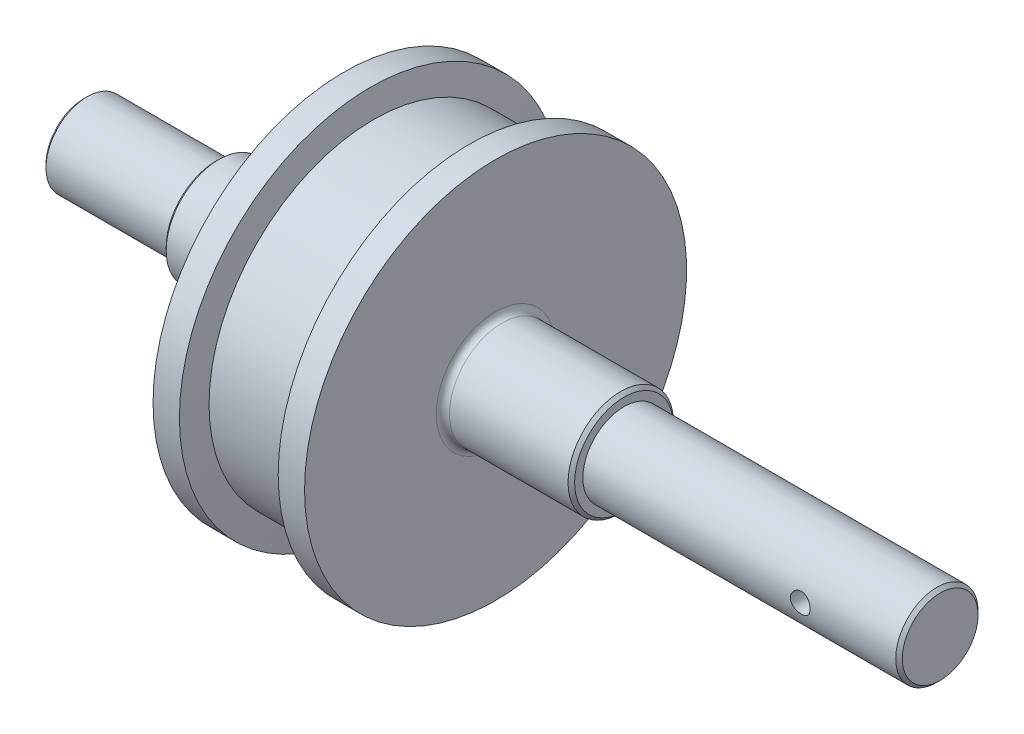
ISO-10303-21;
HEADER;
FILE_DESCRIPTION(('STEP AP214'),'2;1');
FILE_NAME('part.step','',(''),(''),'','','');
FILE_SCHEMA(('AUTOMOTIVE_DESIGN { 1 0 10303 214 1 1 1 1 }'));
ENDSEC;
DATA;
#1=APPLICATION_CONTEXT('core data for automotive mechanical design processes');
#2=APPLICATION_PROTOCOL_DEFINITION('international standard','automotive_design',2000,#1);
#3=PRODUCT_CONTEXT('',#1,'mechanical');
#4=PRODUCT('Part','Part','',(#3));
#5=PRODUCT_RELATED_PRODUCT_CATEGORY('part','',(#4));
#6=PRODUCT_DEFINITION_FORMATION('','',#4);
#7=PRODUCT_DEFINITION_CONTEXT('part definition',#1,'design');
#8=PRODUCT_DEFINITION('design','',#6,#7);
#9=PRODUCT_DEFINITION_SHAPE('','',#8);
#10=(LENGTH_UNIT() NAMED_UNIT(*) SI_UNIT(.MILLI.,.METRE.));
#11=(NAMED_UNIT(*) PLANE_ANGLE_UNIT() SI_UNIT($,.RADIAN.));
#12=(NAMED_UNIT(*) SI_UNIT($,.STERADIAN.) SOLID_ANGLE_UNIT());
#13=UNCERTAINTY_MEASURE_WITH_UNIT(LENGTH_MEASURE(1.E-05),#10,'distance_accuracy_value','');
#14=(GEOMETRIC_REPRESENTATION_CONTEXT(3) GLOBAL_UNCERTAINTY_ASSIGNED_CONTEXT((#13)) GLOBAL_UNIT_ASSIGNED_CONTEXT((#10,
#11,#12)) REPRESENTATION_CONTEXT('',''));
#15=CARTESIAN_POINT('',(0.,0.,0.));
#16=DIRECTION('',(0.,0.,1.));
#17=DIRECTION('',(1.,0.,0.));
#18=AXIS2_PLACEMENT_3D('',#15,#16,#17);
#19=CARTESIAN_POINT('',(260.,0.,0.));
#20=DIRECTION('',(-1.,0.,0.));
#21=DIRECTION('',(0.,0.,1.));
#22=AXIS2_PLACEMENT_3D('',#19,#20,#21);
#23=PLANE('',#22);
#24=CARTESIAN_POINT('',(260.,0.,0.));
#25=DIRECTION('',(-1.,0.,0.));
#26=DIRECTION('',(0.,0.,1.));
#27=AXIS2_PLACEMENT_3D('',#24,#25,#26);
#28=CIRCLE('',#27,11.5);
#29=CARTESIAN_POINT('',(260.,0.,11.5));
#30=VERTEX_POINT('',#29);
#31=EDGE_CURVE('E10',#30,#30,#28,.T.);
#32=ORIENTED_EDGE('',*,*,#31,.F.);
#33=EDGE_LOOP('',(#32));
#34=FACE_BOUND('',#33,.T.);
#35=ADVANCED_FACE('F32',(#34),#23,.F.);
#36=CARTESIAN_POINT('',(260.,0.,0.));
#37=DIRECTION('',(-1.,0.,0.));
#38=DIRECTION('',(0.,0.,1.));
#39=AXIS2_PLACEMENT_3D('',#36,#37,#38);
#40=CONICAL_SURFACE('',#39,11.5,0.785398163397448);
#41=CARTESIAN_POINT('',(259.,0.,0.));
#42=DIRECTION('',(-1.,0.,0.));
#43=DIRECTION('',(0.,0.,1.));
#44=AXIS2_PLACEMENT_3D('',#41,#42,#43);
#45=CIRCLE('',#44,12.5);
#46=CARTESIAN_POINT('',(259.,0.,12.5));
#47=VERTEX_POINT('',#46);
#48=EDGE_CURVE('E44',#47,#47,#45,.T.);
#49=ORIENTED_EDGE('',*,*,#48,.F.);
#50=EDGE_LOOP('',(#49));
#51=FACE_BOUND('',#50,.T.);
#52=ORIENTED_EDGE('',*,*,#31,.T.);
#53=EDGE_LOOP('',(#52));
#54=FACE_BOUND('',#53,.T.);
#55=ADVANCED_FACE('F139',(#51,#54),#40,.T.);
#56=CARTESIAN_POINT('',(0.,0.,0.));
#57=DIRECTION('',(-1.,0.,0.));
#58=DIRECTION('',(0.,0.,1.));
#59=AXIS2_PLACEMENT_3D('',#56,#57,#58);
#60=CYLINDRICAL_SURFACE('',#59,12.5);
#61=CARTESIAN_POINT('',(233.,0.,12.5));
#62=CARTESIAN_POINT('',(232.999994975923,-0.165963929028716,12.4999970714968));
#63=CARTESIAN_POINT('',(232.986181589764,-0.331985420928066,12.4966615634859));
#64=CARTESIAN_POINT('',(232.931367260405,-0.65928429097138,12.4836783946933));
#65=CARTESIAN_POINT('',(232.890349572005,-0.820558683214277,12.4740268462166));
#66=CARTESIAN_POINT('',(232.782507665496,-1.13358839471402,12.4494823208195));
#67=CARTESIAN_POINT('',(232.715713110142,-1.28535442324822,12.4345953702841));
#68=CARTESIAN_POINT('',(232.558314563554,-1.57552517879763,12.4011725442513));
#69=CARTESIAN_POINT('',(232.467710231923,-1.71392971475166,12.3826366165873));
#70=CARTESIAN_POINT('',(232.263435821624,-1.97609263393972,12.3435386014785));
#71=CARTESIAN_POINT('',(232.149397218951,-2.09955952100479,12.3229472454311));
#72=CARTESIAN_POINT('',(231.902281130935,-2.32581080811942,12.2822574370147));
#73=CARTESIAN_POINT('',(231.769201657959,-2.42859304624489,12.2621590363612));
#74=CARTESIAN_POINT('',(231.485554166983,-2.61189993555015,12.224437969062));
#75=CARTESIAN_POINT('',(231.334773416241,-2.69210377047564,12.2068525815312));
#76=CARTESIAN_POINT('',(231.021380164872,-2.82591582947332,12.1765733412448));
#77=CARTESIAN_POINT('',(230.858769397977,-2.87952794169563,12.1638787734309));
#78=CARTESIAN_POINT('',(230.529523426731,-2.95765058108662,12.1451184675007));
#79=CARTESIAN_POINT('',(230.363018878475,-2.98268262400616,12.1389341034343));
#80=CARTESIAN_POINT('',(230.028067620357,-3.00455808879086,12.1335389605945));
#81=CARTESIAN_POINT('',(229.859621204043,-3.00140571682399,12.1343271412568));
#82=CARTESIAN_POINT('',(229.529524033987,-2.96741912081941,12.1426811387008));
#83=CARTESIAN_POINT('',(229.36780543481,-2.93720103400494,12.1500960921292));
#84=CARTESIAN_POINT('',(229.051802683352,-2.85092141637188,12.1706283738785));
#85=CARTESIAN_POINT('',(228.897519024266,-2.79485817372027,12.1837460799133));
#86=CARTESIAN_POINT('',(228.599087021916,-2.65794121231782,12.2143476734445));
#87=CARTESIAN_POINT('',(228.455047547083,-2.57685948246961,12.2318714325758));
#88=CARTESIAN_POINT('',(228.182395499277,-2.39236688956384,12.2692875046196));
#89=CARTESIAN_POINT('',(228.053785434715,-2.28895240342649,12.2891802016137));
#90=CARTESIAN_POINT('',(227.812106429681,-2.05951493908847,12.329732025739));
#91=CARTESIAN_POINT('',(227.699532900938,-1.93297064389908,12.3503975788014));
#92=CARTESIAN_POINT('',(227.497115280254,-1.66255592459691,12.3896951594929));
#93=CARTESIAN_POINT('',(227.407271779707,-1.5186850498214,12.4083271342049));
#94=CARTESIAN_POINT('',(227.252702779387,-1.2170284771858,12.4415394956922));
#95=CARTESIAN_POINT('',(227.188052543762,-1.05920278696053,12.4561077058019));
#96=CARTESIAN_POINT('',(227.086334920951,-0.734497606078659,12.4794620474154));
#97=CARTESIAN_POINT('',(227.049262682373,-0.567619713387648,12.4882491958651));
#98=CARTESIAN_POINT('',(227.004497935348,-0.233787399651655,12.4989027542709));
#99=CARTESIAN_POINT('',(226.996130107538,-0.0669284805449989,12.5009282130753));
#100=CARTESIAN_POINT('',(227.007166766851,0.265804381586635,12.4982807419474));
#101=CARTESIAN_POINT('',(227.026568961987,0.431678404764955,12.4936083648176));
#102=CARTESIAN_POINT('',(227.092036978516,0.755422580108848,12.4781916395217));
#103=CARTESIAN_POINT('',(227.137739109574,0.913370579311305,12.4675301590363));
#104=CARTESIAN_POINT('',(227.254098191695,1.21935330013476,12.4413335015664));
#105=CARTESIAN_POINT('',(227.324757542978,1.3673870666415,12.4257978558334));
#106=CARTESIAN_POINT('',(227.490366593598,1.65206150995569,12.3911910149582));
#107=CARTESIAN_POINT('',(227.585700716924,1.78847176740354,12.3720653178033));
#108=CARTESIAN_POINT('',(227.797456929013,2.04359904096631,12.3324936406987));
#109=CARTESIAN_POINT('',(227.913882356081,2.16231325074335,12.3120474520734));
#110=CARTESIAN_POINT('',(228.167640831209,2.3814245378994,12.2715742142771));
#111=CARTESIAN_POINT('',(228.305385122082,2.4813497404737,12.2515669262668));
#112=CARTESIAN_POINT('',(228.596090427897,2.65666020824082,12.2147538797452));
#113=CARTESIAN_POINT('',(228.749050761094,2.7320465722335,12.1979479778962));
#114=CARTESIAN_POINT('',(229.065012513544,2.85558993518171,12.1696189519335));
#115=CARTESIAN_POINT('',(229.227948203421,2.90390754385904,12.1580647463107));
#116=CARTESIAN_POINT('',(229.559946185021,2.97238380283978,12.1415072663683));
#117=CARTESIAN_POINT('',(229.729007253762,2.9925480427499,12.1365026916888));
#118=CARTESIAN_POINT('',(230.063670700281,3.00387066449353,12.1337046220624));
#119=CARTESIAN_POINT('',(230.229246496327,2.99578106592265,12.1357241633848));
#120=CARTESIAN_POINT('',(230.556599764224,2.95253345626266,12.1463176460425));
#121=CARTESIAN_POINT('',(230.718377301111,2.91737590900096,12.1548914750658));
#122=CARTESIAN_POINT('',(231.032797552548,2.82138591303536,12.1775274976748));
#123=CARTESIAN_POINT('',(231.185482272584,2.76068402045611,12.191561756094));
#124=CARTESIAN_POINT('',(231.478604413884,2.61543373580582,12.2235433612686));
#125=CARTESIAN_POINT('',(231.619040268586,2.53088229934854,12.2414912075257));
#126=CARTESIAN_POINT('',(231.88733700012,2.33793007708463,12.279819325529));
#127=CARTESIAN_POINT('',(232.014812323099,2.22900267979019,12.3002478697533));
#128=CARTESIAN_POINT('',(232.249919988052,1.99143074773237,12.3409359831145));
#129=CARTESIAN_POINT('',(232.35754766321,1.86278158874234,12.361195511444));
#130=CARTESIAN_POINT('',(232.551609259555,1.5868829988014,12.3996570299581));
#131=CARTESIAN_POINT('',(232.637668405442,1.43936414359402,12.4178200201219));
#132=CARTESIAN_POINT('',(232.783629532748,1.13153622828568,12.4496380610582));
#133=CARTESIAN_POINT('',(232.843551343392,0.971236973691223,12.4632965272855));
#134=CARTESIAN_POINT('',(232.926038625138,0.675887025694764,12.4824059901497));
#135=CARTESIAN_POINT('',(232.953716615786,0.542312066268419,12.4889599449579));
#136=CARTESIAN_POINT('',(232.990698780852,0.272504227478247,12.4977580149525));
#137=CARTESIAN_POINT('',(233.000004125226,0.136271517915776,12.5000024045682));
#138=CARTESIAN_POINT('',(233.,0.,12.5));
#139=B_SPLINE_CURVE_WITH_KNOTS('',3,(#61,#62,#63,#64,#65,#66,#67,#68,#69,#70,#71,#72,#73,#74,
#75,#76,#77,#78,#79,#80,#81,#82,#83,#84,#85,#86,#87,#88,#89,#90,#91,#92,#93,#94,#95,#96,#97,#98,
#99,#100,#101,#102,#103,#104,#105,#106,#107,#108,#109,#110,#111,#112,#113,#114,#115,#116,#117,
#118,#119,#120,#121,#122,#123,#124,#125,#126,#127,#128,#129,#130,#131,#132,#133,#134,#135,#136,
#137,#138),.UNSPECIFIED.,.T.,.F.,(4,2,2,2,2,2,2,2,2,2,2,2,2,2,2,2,2,2,2,2,2,2,2,2,2,2,2,2,2,2,2,
2,2,2,2,2,2,2,4),(0.,0.497392599366679,0.995091645758823,1.49221966408501,1.98935478998519,
2.49500570148356,3.00070943533305,3.51327262050847,4.02576083835035,4.52873995359107,
5.03164400680465,5.52338274964837,6.01515406709135,6.51154667521167,7.0080198745,
7.51749958381933,8.02699254752169,8.53799614678202,9.04890983140414,9.54771776810824,
10.0464845383097,10.5385143736981,11.0305915421211,11.5308523313794,12.031192370573,
12.5427824523192,13.0543496229377,13.5628484119093,14.0712462285018,14.5662165454702,
15.0611783809799,15.5536406351284,16.0461657803878,16.550584461043,17.0551215958269,
17.5678974206351,18.0802835459068,18.4887142303991,18.897118905514),.UNSPECIFIED.);
#140=CARTESIAN_POINT('',(233.,0.,12.5));
#141=VERTEX_POINT('',#140);
#142=EDGE_CURVE('E35',#141,#141,#139,.T.);
#143=ORIENTED_EDGE('',*,*,#142,.T.);
#144=EDGE_LOOP('',(#143));
#145=FACE_BOUND('',#144,.T.);
#146=CARTESIAN_POINT('',(233.,0.,-12.5));
#147=CARTESIAN_POINT('',(232.999994975923,0.165963929028716,-12.4999970714968));
#148=CARTESIAN_POINT('',(232.986181589764,0.331985420928066,-12.4966615634859));
#149=CARTESIAN_POINT('',(232.931367260405,0.65928429097138,-12.4836783946933));
#150=CARTESIAN_POINT('',(232.890349572005,0.820558683214277,-12.4740268462166));
#151=CARTESIAN_POINT('',(232.782507665496,1.13358839471402,-12.4494823208195));
#152=CARTESIAN_POINT('',(232.715713110142,1.28535442324822,-12.4345953702841));
#153=CARTESIAN_POINT('',(232.558314563554,1.57552517879763,-12.4011725442513));
#154=CARTESIAN_POINT('',(232.467710231923,1.71392971475166,-12.3826366165873));
#155=CARTESIAN_POINT('',(232.263435821624,1.97609263393972,-12.3435386014785));
#156=CARTESIAN_POINT('',(232.149397218951,2.09955952100479,-12.3229472454311));
#157=CARTESIAN_POINT('',(231.902281130935,2.32581080811942,-12.2822574370147));
#158=CARTESIAN_POINT('',(231.769201657959,2.42859304624489,-12.2621590363612));
#159=CARTESIAN_POINT('',(231.485554166983,2.61189993555015,-12.224437969062));
#160=CARTESIAN_POINT('',(231.334773416241,2.69210377047564,-12.2068525815312));
#161=CARTESIAN_POINT('',(231.021380164872,2.82591582947332,-12.1765733412448));
#162=CARTESIAN_POINT('',(230.858769397977,2.87952794169563,-12.1638787734309));
#163=CARTESIAN_POINT('',(230.529523426731,2.95765058108662,-12.1451184675007));
#164=CARTESIAN_POINT('',(230.363018878475,2.98268262400616,-12.1389341034343));
#165=CARTESIAN_POINT('',(230.028067620357,3.00455808879086,-12.1335389605945));
#166=CARTESIAN_POINT('',(229.859621204043,3.00140571682399,-12.1343271412568));
#167=CARTESIAN_POINT('',(229.529524033987,2.96741912081941,-12.1426811387008));
#168=CARTESIAN_POINT('',(229.36780543481,2.93720103400494,-12.1500960921292));
#169=CARTESIAN_POINT('',(229.051802683352,2.85092141637188,-12.1706283738785));
#170=CARTESIAN_POINT('',(228.897519024266,2.79485817372027,-12.1837460799133));
#171=CARTESIAN_POINT('',(228.599087021916,2.65794121231782,-12.2143476734445));
#172=CARTESIAN_POINT('',(228.455047547083,2.57685948246961,-12.2318714325758));
#173=CARTESIAN_POINT('',(228.182395499277,2.39236688956384,-12.2692875046196));
#174=CARTESIAN_POINT('',(228.053785434715,2.28895240342649,-12.2891802016137));
#175=CARTESIAN_POINT('',(227.812106429681,2.05951493908847,-12.329732025739));
#176=CARTESIAN_POINT('',(227.699532900938,1.93297064389908,-12.3503975788014));
#177=CARTESIAN_POINT('',(227.497115280254,1.66255592459691,-12.3896951594929));
#178=CARTESIAN_POINT('',(227.407271779707,1.5186850498214,-12.4083271342049));
#179=CARTESIAN_POINT('',(227.252702779387,1.2170284771858,-12.4415394956922));
#180=CARTESIAN_POINT('',(227.188052543762,1.05920278696053,-12.4561077058019));
#181=CARTESIAN_POINT('',(227.086334920951,0.734497606078659,-12.4794620474154));
#182=CARTESIAN_POINT('',(227.049262682373,0.567619713387648,-12.4882491958651));
#183=CARTESIAN_POINT('',(227.004497935348,0.233787399651655,-12.4989027542709));
#184=CARTESIAN_POINT('',(226.996130107538,0.0669284805449989,-12.5009282130753));
#185=CARTESIAN_POINT('',(227.007166766851,-0.265804381586635,-12.4982807419474));
#186=CARTESIAN_POINT('',(227.026568961987,-0.431678404764955,-12.4936083648176));
#187=CARTESIAN_POINT('',(227.092036978516,-0.755422580108848,-12.4781916395217));
#188=CARTESIAN_POINT('',(227.137739109574,-0.913370579311305,-12.4675301590363));
#189=CARTESIAN_POINT('',(227.254098191695,-1.21935330013476,-12.4413335015664));
#190=CARTESIAN_POINT('',(227.324757542978,-1.3673870666415,-12.4257978558334));
#191=CARTESIAN_POINT('',(227.490366593598,-1.65206150995569,-12.3911910149582));
#192=CARTESIAN_POINT('',(227.585700716924,-1.78847176740354,-12.3720653178033));
#193=CARTESIAN_POINT('',(227.797456929013,-2.04359904096631,-12.3324936406987));
#194=CARTESIAN_POINT('',(227.913882356081,-2.16231325074335,-12.3120474520734));
#195=CARTESIAN_POINT('',(228.167640831209,-2.3814245378994,-12.2715742142771));
#196=CARTESIAN_POINT('',(228.305385122082,-2.4813497404737,-12.2515669262668));
#197=CARTESIAN_POINT('',(228.596090427897,-2.65666020824082,-12.2147538797452));
#198=CARTESIAN_POINT('',(228.749050761094,-2.7320465722335,-12.1979479778962));
#199=CARTESIAN_POINT('',(229.065012513544,-2.85558993518171,-12.1696189519335));
#200=CARTESIAN_POINT('',(229.227948203421,-2.90390754385904,-12.1580647463107));
#201=CARTESIAN_POINT('',(229.559946185021,-2.97238380283978,-12.1415072663683));
#202=CARTESIAN_POINT('',(229.729007253762,-2.9925480427499,-12.1365026916888));
#203=CARTESIAN_POINT('',(230.063670700281,-3.00387066449353,-12.1337046220624));
#204=CARTESIAN_POINT('',(230.229246496327,-2.99578106592265,-12.1357241633848));
#205=CARTESIAN_POINT('',(230.556599764224,-2.95253345626266,-12.1463176460425));
#206=CARTESIAN_POINT('',(230.718377301111,-2.91737590900096,-12.1548914750658));
#207=CARTESIAN_POINT('',(231.032797552548,-2.82138591303536,-12.1775274976748));
#208=CARTESIAN_POINT('',(231.185482272584,-2.76068402045611,-12.191561756094));
#209=CARTESIAN_POINT('',(231.478604413884,-2.61543373580582,-12.2235433612686));
#210=CARTESIAN_POINT('',(231.619040268586,-2.53088229934854,-12.2414912075257));
#211=CARTESIAN_POINT('',(231.88733700012,-2.33793007708463,-12.279819325529));
#212=CARTESIAN_POINT('',(232.014812323099,-2.22900267979019,-12.3002478697533));
#213=CARTESIAN_POINT('',(232.249919988052,-1.99143074773237,-12.3409359831145));
#214=CARTESIAN_POINT('',(232.35754766321,-1.86278158874234,-12.361195511444));
#215=CARTESIAN_POINT('',(232.551609259555,-1.5868829988014,-12.3996570299581));
#216=CARTESIAN_POINT('',(232.637668405442,-1.43936414359402,-12.4178200201219));
#217=CARTESIAN_POINT('',(232.783629532748,-1.13153622828568,-12.4496380610582));
#218=CARTESIAN_POINT('',(232.843551343392,-0.971236973691223,-12.4632965272855));
#219=CARTESIAN_POINT('',(232.926038625138,-0.675887025694764,-12.4824059901497));
#220=CARTESIAN_POINT('',(232.953716615786,-0.542312066268419,-12.4889599449579));
#221=CARTESIAN_POINT('',(232.990698780852,-0.272504227478247,-12.4977580149525));
#222=CARTESIAN_POINT('',(233.000004125226,-0.136271517915776,-12.5000024045682));
#223=CARTESIAN_POINT('',(233.,0.,-12.5));
#224=B_SPLINE_CURVE_WITH_KNOTS('',3,(#146,#147,#148,#149,#150,#151,#152,#153,#154,#155,#156,
#157,#158,#159,#160,#161,#162,#163,#164,#165,#166,#167,#168,#169,#170,#171,#172,#173,#174,#175,
#176,#177,#178,#179,#180,#181,#182,#183,#184,#185,#186,#187,#188,#189,#190,#191,#192,#193,#194,
#195,#196,#197,#198,#199,#200,#201,#202,#203,#204,#205,#206,#207,#208,#209,#210,#211,#212,#213,
#214,#215,#216,#217,#218,#219,#220,#221,#222,#223),.UNSPECIFIED.,.T.,.F.,(4,2,2,2,2,2,2,2,2,2,2,
2,2,2,2,2,2,2,2,2,2,2,2,2,2,2,2,2,2,2,2,2,2,2,2,2,2,2,4),(0.,0.497392599366679,
0.995091645758823,1.49221966408501,1.98935478998519,2.49500570148356,3.00070943533305,
3.51327262050847,4.02576083835035,4.52873995359107,5.03164400680465,5.52338274964837,
6.01515406709135,6.51154667521167,7.0080198745,7.51749958381933,8.02699254752169,
8.53799614678202,9.04890983140414,9.54771776810824,10.0464845383097,10.5385143736981,
11.0305915421211,11.5308523313794,12.031192370573,12.5427824523192,13.0543496229377,
13.5628484119093,14.0712462285018,14.5662165454702,15.0611783809799,15.5536406351284,
16.0461657803878,16.550584461043,17.0551215958269,17.5678974206351,18.0802835459068,
18.4887142303991,18.897118905514),.UNSPECIFIED.);
#225=CARTESIAN_POINT('',(233.,0.,-12.5));
#226=VERTEX_POINT('',#225);
#227=EDGE_CURVE('E52',#226,#226,#224,.T.);
#228=ORIENTED_EDGE('',*,*,#227,.T.);
#229=EDGE_LOOP('',(#228));
#230=FACE_BOUND('',#229,.T.);
#231=CARTESIAN_POINT('',(164.,0.,0.));
#232=DIRECTION('',(-1.,0.,0.));
#233=DIRECTION('',(0.,0.,1.));
#234=AXIS2_PLACEMENT_3D('',#231,#232,#233);
#235=CIRCLE('',#234,12.5);
#236=CARTESIAN_POINT('',(164.,0.,12.5));
#237=VERTEX_POINT('',#236);
#238=EDGE_CURVE('E49',#237,#237,#235,.T.);
#239=ORIENTED_EDGE('',*,*,#238,.F.);
#240=EDGE_LOOP('',(#239));
#241=FACE_BOUND('',#240,.T.);
#242=ORIENTED_EDGE('',*,*,#48,.T.);
#243=EDGE_LOOP('',(#242));
#244=FACE_BOUND('',#243,.T.);
#245=ADVANCED_FACE('F57',(#145,#230,#241,#244),#60,.T.);
#246=CARTESIAN_POINT('',(164.,15.,0.));
#247=DIRECTION('',(-1.,0.,0.));
#248=DIRECTION('',(0.,0.,1.));
#249=AXIS2_PLACEMENT_3D('',#246,#247,#248);
#250=PLANE('',#249);
#251=CARTESIAN_POINT('',(164.,0.,0.));
#252=DIRECTION('',(-1.,0.,0.));
#253=DIRECTION('',(0.,0.,1.));
#254=AXIS2_PLACEMENT_3D('',#251,#252,#253);
#255=CIRCLE('',#254,15.);
#256=CARTESIAN_POINT('',(164.,0.,15.));
#257=VERTEX_POINT('',#256);
#258=EDGE_CURVE('E280',#257,#257,#255,.T.);
#259=ORIENTED_EDGE('',*,*,#258,.F.);
#260=EDGE_LOOP('',(#259));
#261=FACE_BOUND('',#260,.T.);
#262=ORIENTED_EDGE('',*,*,#238,.T.);
#263=EDGE_LOOP('',(#262));
#264=FACE_BOUND('',#263,.T.);
#265=ADVANCED_FACE('F132',(#261,#264),#250,.F.);
#266=CARTESIAN_POINT('',(164.,0.,0.));
#267=DIRECTION('',(-1.,0.,0.));
#268=DIRECTION('',(0.,0.,1.));
#269=AXIS2_PLACEMENT_3D('',#266,#267,#268);
#270=CONICAL_SURFACE('',#269,15.,0.785398163397448);
#271=CARTESIAN_POINT('',(163.,0.,0.));
#272=DIRECTION('',(-1.,0.,0.));
#273=DIRECTION('',(0.,0.,1.));
#274=AXIS2_PLACEMENT_3D('',#271,#272,#273);
#275=CIRCLE('',#274,16.);
#276=CARTESIAN_POINT('',(163.,0.,16.));
#277=VERTEX_POINT('',#276);
#278=EDGE_CURVE('E284',#277,#277,#275,.T.);
#279=ORIENTED_EDGE('',*,*,#278,.F.);
#280=EDGE_LOOP('',(#279));
#281=FACE_BOUND('',#280,.T.);
#282=ORIENTED_EDGE('',*,*,#258,.T.);
#283=EDGE_LOOP('',(#282));
#284=FACE_BOUND('',#283,.T.);
#285=ADVANCED_FACE('F129',(#281,#284),#270,.T.);
#286=CARTESIAN_POINT('',(0.,0.,0.));
#287=DIRECTION('',(-1.,0.,0.));
#288=DIRECTION('',(0.,0.,1.));
#289=AXIS2_PLACEMENT_3D('',#286,#287,#288);
#290=CYLINDRICAL_SURFACE('',#289,16.);
#291=CARTESIAN_POINT('',(127.,0.,0.));
#292=DIRECTION('',(-1.,0.,0.));
#293=DIRECTION('',(0.,0.,1.));
#294=AXIS2_PLACEMENT_3D('',#291,#292,#293);
#295=CIRCLE('',#294,16.);
#296=CARTESIAN_POINT('',(127.,0.,16.));
#297=VERTEX_POINT('',#296);
#298=EDGE_CURVE('E289',#297,#297,#295,.T.);
#299=ORIENTED_EDGE('',*,*,#298,.F.);
#300=EDGE_LOOP('',(#299));
#301=FACE_BOUND('',#300,.T.);
#302=ORIENTED_EDGE('',*,*,#278,.T.);
#303=EDGE_LOOP('',(#302));
#304=FACE_BOUND('',#303,.T.);
#305=ADVANCED_FACE('F125',(#301,#304),#290,.T.);
#306=CARTESIAN_POINT('',(127.,0.,0.));
#307=DIRECTION('',(-1.,0.,0.));
#308=DIRECTION('',(0.,0.,1.));
#309=AXIS2_PLACEMENT_3D('',#306,#307,#308);
#310=TOROIDAL_SURFACE('',#309,18.,2.00000000000002);
#311=CARTESIAN_POINT('',(125.,0.,0.));
#312=DIRECTION('',(-1.,0.,0.));
#313=DIRECTION('',(0.,0.,1.));
#314=AXIS2_PLACEMENT_3D('',#311,#312,#313);
#315=CIRCLE('',#314,18.);
#316=CARTESIAN_POINT('',(125.,0.,18.));
#317=VERTEX_POINT('',#316);
#318=EDGE_CURVE('E292',#317,#317,#315,.T.);
#319=ORIENTED_EDGE('',*,*,#318,.F.);
#320=EDGE_LOOP('',(#319));
#321=FACE_BOUND('',#320,.T.);
#322=ORIENTED_EDGE('',*,*,#298,.T.);
#323=EDGE_LOOP('',(#322));
#324=FACE_BOUND('',#323,.T.);
#325=ADVANCED_FACE('F121',(#321,#324),#310,.F.);
#326=CARTESIAN_POINT('',(125.,58.,0.));
#327=DIRECTION('',(-1.,0.,0.));
#328=DIRECTION('',(0.,0.,1.));
#329=AXIS2_PLACEMENT_3D('',#326,#327,#328);
#330=PLANE('',#329);
#331=CARTESIAN_POINT('',(125.,0.,0.));
#332=DIRECTION('',(-1.,0.,0.));
#333=DIRECTION('',(0.,0.,1.));
#334=AXIS2_PLACEMENT_3D('',#331,#332,#333);
#335=CIRCLE('',#334,58.);
#336=CARTESIAN_POINT('',(125.,0.,58.));
#337=VERTEX_POINT('',#336);
#338=EDGE_CURVE('E295',#337,#337,#335,.T.);
#339=ORIENTED_EDGE('',*,*,#338,.F.);
#340=EDGE_LOOP('',(#339));
#341=FACE_BOUND('',#340,.T.);
#342=ORIENTED_EDGE('',*,*,#318,.T.);
#343=EDGE_LOOP('',(#342));
#344=FACE_BOUND('',#343,.T.);
#345=ADVANCED_FACE('F117',(#341,#344),#330,.F.);
#346=CARTESIAN_POINT('',(0.,0.,0.));
#347=DIRECTION('',(-1.,0.,0.));
#348=DIRECTION('',(0.,0.,1.));
#349=AXIS2_PLACEMENT_3D('',#346,#347,#348);
#350=CYLINDRICAL_SURFACE('',#349,58.);
#351=CARTESIAN_POINT('',(117.,0.,0.));
#352=DIRECTION('',(-1.,0.,0.));
#353=DIRECTION('',(0.,0.,1.));
#354=AXIS2_PLACEMENT_3D('',#351,#352,#353);
#355=CIRCLE('',#354,58.);
#356=CARTESIAN_POINT('',(117.,0.,58.));
#357=VERTEX_POINT('',#356);
#358=EDGE_CURVE('E298',#357,#357,#355,.T.);
#359=ORIENTED_EDGE('',*,*,#358,.F.);
#360=EDGE_LOOP('',(#359));
#361=FACE_BOUND('',#360,.T.);
#362=ORIENTED_EDGE('',*,*,#338,.T.);
#363=EDGE_LOOP('',(#362));
#364=FACE_BOUND('',#363,.T.);
#365=ADVANCED_FACE('F113',(#361,#364),#350,.T.);
#366=CARTESIAN_POINT('',(117.,0.,0.));
#367=DIRECTION('',(1.,0.,0.));
#368=DIRECTION('',(0.,0.,-1.));
#369=AXIS2_PLACEMENT_3D('',#366,#367,#368);
#370=CONICAL_SURFACE('',#369,58.,1.44644133224814);
#371=CARTESIAN_POINT('',(116.,0.,0.));
#372=DIRECTION('',(-1.,0.,0.));
#373=DIRECTION('',(0.,0.,1.));
#374=AXIS2_PLACEMENT_3D('',#371,#372,#373);
#375=CIRCLE('',#374,50.);
#376=CARTESIAN_POINT('',(116.,0.,50.));
#377=VERTEX_POINT('',#376);
#378=EDGE_CURVE('E301',#377,#377,#375,.T.);
#379=ORIENTED_EDGE('',*,*,#378,.F.);
#380=EDGE_LOOP('',(#379));
#381=FACE_BOUND('',#380,.T.);
#382=ORIENTED_EDGE('',*,*,#358,.T.);
#383=EDGE_LOOP('',(#382));
#384=FACE_BOUND('',#383,.T.);
#385=ADVANCED_FACE('F109',(#381,#384),#370,.T.);
#386=CARTESIAN_POINT('',(0.,0.,0.));
#387=DIRECTION('',(-1.,0.,0.));
#388=DIRECTION('',(0.,0.,1.));
#389=AXIS2_PLACEMENT_3D('',#386,#387,#388);
#390=CYLINDRICAL_SURFACE('',#389,50.);
#391=CARTESIAN_POINT('',(88.,0.,0.));
#392=DIRECTION('',(-1.,0.,0.));
#393=DIRECTION('',(0.,0.,1.));
#394=AXIS2_PLACEMENT_3D('',#391,#392,#393);
#395=CIRCLE('',#394,50.);
#396=CARTESIAN_POINT('',(88.,0.,50.));
#397=VERTEX_POINT('',#396);
#398=EDGE_CURVE('E304',#397,#397,#395,.T.);
#399=ORIENTED_EDGE('',*,*,#398,.F.);
#400=EDGE_LOOP('',(#399));
#401=FACE_BOUND('',#400,.T.);
#402=ORIENTED_EDGE('',*,*,#378,.T.);
#403=EDGE_LOOP('',(#402));
#404=FACE_BOUND('',#403,.T.);
#405=ADVANCED_FACE('F105',(#401,#404),#390,.T.);
#406=CARTESIAN_POINT('',(88.,0.,0.));
#407=DIRECTION('',(-1.,0.,0.));
#408=DIRECTION('',(0.,0.,1.));
#409=AXIS2_PLACEMENT_3D('',#406,#407,#408);
#410=CONICAL_SURFACE('',#409,50.,1.44644133224814);
#411=CARTESIAN_POINT('',(87.,0.,0.));
#412=DIRECTION('',(-1.,0.,0.));
#413=DIRECTION('',(0.,0.,1.));
#414=AXIS2_PLACEMENT_3D('',#411,#412,#413);
#415=CIRCLE('',#414,58.);
#416=CARTESIAN_POINT('',(87.,0.,58.));
#417=VERTEX_POINT('',#416);
#418=EDGE_CURVE('E307',#417,#417,#415,.T.);
#419=ORIENTED_EDGE('',*,*,#418,.F.);
#420=EDGE_LOOP('',(#419));
#421=FACE_BOUND('',#420,.T.);
#422=ORIENTED_EDGE('',*,*,#398,.T.);
#423=EDGE_LOOP('',(#422));
#424=FACE_BOUND('',#423,.T.);
#425=ADVANCED_FACE('F101',(#421,#424),#410,.T.);
#426=CARTESIAN_POINT('',(0.,0.,0.));
#427=DIRECTION('',(-1.,0.,0.));
#428=DIRECTION('',(0.,0.,1.));
#429=AXIS2_PLACEMENT_3D('',#426,#427,#428);
#430=CYLINDRICAL_SURFACE('',#429,58.);
#431=CARTESIAN_POINT('',(79.,0.,0.));
#432=DIRECTION('',(-1.,0.,0.));
#433=DIRECTION('',(0.,0.,1.));
#434=AXIS2_PLACEMENT_3D('',#431,#432,#433);
#435=CIRCLE('',#434,58.);
#436=CARTESIAN_POINT('',(79.,0.,58.));
#437=VERTEX_POINT('',#436);
#438=EDGE_CURVE('E310',#437,#437,#435,.T.);
#439=ORIENTED_EDGE('',*,*,#438,.F.);
#440=EDGE_LOOP('',(#439));
#441=FACE_BOUND('',#440,.T.);
#442=ORIENTED_EDGE('',*,*,#418,.T.);
#443=EDGE_LOOP('',(#442));
#444=FACE_BOUND('',#443,.T.);
#445=ADVANCED_FACE('F97',(#441,#444),#430,.T.);
#446=CARTESIAN_POINT('',(79.,18.,0.));
#447=DIRECTION('',(1.,0.,0.));
#448=DIRECTION('',(0.,0.,-1.));
#449=AXIS2_PLACEMENT_3D('',#446,#447,#448);
#450=PLANE('',#449);
#451=CARTESIAN_POINT('',(79.,0.,0.));
#452=DIRECTION('',(-1.,0.,0.));
#453=DIRECTION('',(0.,0.,1.));
#454=AXIS2_PLACEMENT_3D('',#451,#452,#453);
#455=CIRCLE('',#454,18.);
#456=CARTESIAN_POINT('',(79.,0.,18.));
#457=VERTEX_POINT('',#456);
#458=EDGE_CURVE('E313',#457,#457,#455,.T.);
#459=ORIENTED_EDGE('',*,*,#458,.F.);
#460=EDGE_LOOP('',(#459));
#461=FACE_BOUND('',#460,.T.);
#462=ORIENTED_EDGE('',*,*,#438,.T.);
#463=EDGE_LOOP('',(#462));
#464=FACE_BOUND('',#463,.T.);
#465=ADVANCED_FACE('F93',(#461,#464),#450,.F.);
#466=CARTESIAN_POINT('',(77.,0.,0.));
#467=DIRECTION('',(-1.,0.,0.));
#468=DIRECTION('',(0.,0.,1.));
#469=AXIS2_PLACEMENT_3D('',#466,#467,#468);
#470=TOROIDAL_SURFACE('',#469,18.,2.);
#471=CARTESIAN_POINT('',(77.,0.,0.));
#472=DIRECTION('',(-1.,0.,0.));
#473=DIRECTION('',(0.,0.,1.));
#474=AXIS2_PLACEMENT_3D('',#471,#472,#473);
#475=CIRCLE('',#474,16.);
#476=CARTESIAN_POINT('',(77.,0.,16.));
#477=VERTEX_POINT('',#476);
#478=EDGE_CURVE('E316',#477,#477,#475,.T.);
#479=ORIENTED_EDGE('',*,*,#478,.F.);
#480=EDGE_LOOP('',(#479));
#481=FACE_BOUND('',#480,.T.);
#482=ORIENTED_EDGE('',*,*,#458,.T.);
#483=EDGE_LOOP('',(#482));
#484=FACE_BOUND('',#483,.T.);
#485=ADVANCED_FACE('F89',(#481,#484),#470,.F.);
#486=CARTESIAN_POINT('',(0.,0.,0.));
#487=DIRECTION('',(-1.,0.,0.));
#488=DIRECTION('',(0.,0.,1.));
#489=AXIS2_PLACEMENT_3D('',#486,#487,#488);
#490=CYLINDRICAL_SURFACE('',#489,16.);
#491=CARTESIAN_POINT('',(41.,0.,0.));
#492=DIRECTION('',(-1.,0.,0.));
#493=DIRECTION('',(0.,0.,1.));
#494=AXIS2_PLACEMENT_3D('',#491,#492,#493);
#495=CIRCLE('',#494,16.);
#496=CARTESIAN_POINT('',(41.,0.,16.));
#497=VERTEX_POINT('',#496);
#498=EDGE_CURVE('E319',#497,#497,#495,.T.);
#499=ORIENTED_EDGE('',*,*,#498,.F.);
#500=EDGE_LOOP('',(#499));
#501=FACE_BOUND('',#500,.T.);
#502=ORIENTED_EDGE('',*,*,#478,.T.);
#503=EDGE_LOOP('',(#502));
#504=FACE_BOUND('',#503,.T.);
#505=ADVANCED_FACE('F85',(#501,#504),#490,.T.);
#506=CARTESIAN_POINT('',(41.,0.,0.));
#507=DIRECTION('',(1.,0.,0.));
#508=DIRECTION('',(0.,0.,-1.));
#509=AXIS2_PLACEMENT_3D('',#506,#507,#508);
#510=CONICAL_SURFACE('',#509,16.,0.785398163397448);
#511=CARTESIAN_POINT('',(40.,0.,0.));
#512=DIRECTION('',(-1.,0.,0.));
#513=DIRECTION('',(0.,0.,1.));
#514=AXIS2_PLACEMENT_3D('',#511,#512,#513);
#515=CIRCLE('',#514,15.);
#516=CARTESIAN_POINT('',(40.,0.,15.));
#517=VERTEX_POINT('',#516);
#518=EDGE_CURVE('E322',#517,#517,#515,.T.);
#519=ORIENTED_EDGE('',*,*,#518,.F.);
#520=EDGE_LOOP('',(#519));
#521=FACE_BOUND('',#520,.T.);
#522=ORIENTED_EDGE('',*,*,#498,.T.);
#523=EDGE_LOOP('',(#522));
#524=FACE_BOUND('',#523,.T.);
#525=ADVANCED_FACE('F81',(#521,#524),#510,.T.);
#526=CARTESIAN_POINT('',(40.,15.,0.));
#527=DIRECTION('',(1.,0.,0.));
#528=DIRECTION('',(0.,0.,-1.));
#529=AXIS2_PLACEMENT_3D('',#526,#527,#528);
#530=PLANE('',#529);
#531=CARTESIAN_POINT('',(40.,0.,0.));
#532=DIRECTION('',(-1.,0.,0.));
#533=DIRECTION('',(0.,0.,1.));
#534=AXIS2_PLACEMENT_3D('',#531,#532,#533);
#535=CIRCLE('',#534,12.5);
#536=CARTESIAN_POINT('',(40.,0.,12.5));
#537=VERTEX_POINT('',#536);
#538=EDGE_CURVE('E325',#537,#537,#535,.T.);
#539=ORIENTED_EDGE('',*,*,#538,.F.);
#540=EDGE_LOOP('',(#539));
#541=FACE_BOUND('',#540,.T.);
#542=ORIENTED_EDGE('',*,*,#518,.T.);
#543=EDGE_LOOP('',(#542));
#544=FACE_BOUND('',#543,.T.);
#545=ADVANCED_FACE('F77',(#541,#544),#530,.F.);
#546=CARTESIAN_POINT('',(0.,0.,0.));
#547=DIRECTION('',(-1.,0.,0.));
#548=DIRECTION('',(0.,0.,1.));
#549=AXIS2_PLACEMENT_3D('',#546,#547,#548);
#550=CYLINDRICAL_SURFACE('',#549,12.5);
#551=CARTESIAN_POINT('',(1.,0.,0.));
#552=DIRECTION('',(-1.,0.,0.));
#553=DIRECTION('',(0.,0.,1.));
#554=AXIS2_PLACEMENT_3D('',#551,#552,#553);
#555=CIRCLE('',#554,12.5);
#556=CARTESIAN_POINT('',(1.,0.,12.5));
#557=VERTEX_POINT('',#556);
#558=EDGE_CURVE('E328',#557,#557,#555,.T.);
#559=ORIENTED_EDGE('',*,*,#558,.F.);
#560=EDGE_LOOP('',(#559));
#561=FACE_BOUND('',#560,.T.);
#562=ORIENTED_EDGE('',*,*,#538,.T.);
#563=EDGE_LOOP('',(#562));
#564=FACE_BOUND('',#563,.T.);
#565=ADVANCED_FACE('F73',(#561,#564),#550,.T.);
#566=CARTESIAN_POINT('',(1.,0.,0.));
#567=DIRECTION('',(1.,0.,0.));
#568=DIRECTION('',(0.,0.,-1.));
#569=AXIS2_PLACEMENT_3D('',#566,#567,#568);
#570=CONICAL_SURFACE('',#569,12.5,0.785398163397449);
#571=CARTESIAN_POINT('',(0.,0.,0.));
#572=DIRECTION('',(-1.,0.,0.));
#573=DIRECTION('',(0.,0.,1.));
#574=AXIS2_PLACEMENT_3D('',#571,#572,#573);
#575=CIRCLE('',#574,11.5);
#576=CARTESIAN_POINT('',(0.,0.,11.5));
#577=VERTEX_POINT('',#576);
#578=EDGE_CURVE('E331',#577,#577,#575,.T.);
#579=ORIENTED_EDGE('',*,*,#578,.F.);
#580=EDGE_LOOP('',(#579));
#581=FACE_BOUND('',#580,.T.);
#582=ORIENTED_EDGE('',*,*,#558,.T.);
#583=EDGE_LOOP('',(#582));
#584=FACE_BOUND('',#583,.T.);
#585=ADVANCED_FACE('F69',(#581,#584),#570,.T.);
#586=CARTESIAN_POINT('',(0.,0.,0.));
#587=DIRECTION('',(1.,0.,0.));
#588=DIRECTION('',(0.,0.,-1.));
#589=AXIS2_PLACEMENT_3D('',#586,#587,#588);
#590=PLANE('',#589);
#591=ORIENTED_EDGE('',*,*,#578,.T.);
#592=EDGE_LOOP('',(#591));
#593=FACE_BOUND('',#592,.T.);
#594=ADVANCED_FACE('F64',(#593),#590,.F.);
#595=CARTESIAN_POINT('',(230.,0.,-15.));
#596=DIRECTION('',(0.,0.,1.));
#597=DIRECTION('',(1.,0.,0.));
#598=AXIS2_PLACEMENT_3D('',#595,#596,#597);
#599=CYLINDRICAL_SURFACE('',#598,2.99999999999999);
#600=ORIENTED_EDGE('',*,*,#227,.F.);
#601=EDGE_LOOP('',(#600));
#602=FACE_BOUND('',#601,.T.);
#603=ORIENTED_EDGE('',*,*,#142,.F.);
#604=EDGE_LOOP('',(#603));
#605=FACE_BOUND('',#604,.T.);
#606=ADVANCED_FACE('F60',(#602,#605),#599,.F.);
#607=CLOSED_SHELL('',(#35,#55,#245,#265,#285,#305,#325,#345,#365,#385,#405,#425,#445,#465,#485,
#505,#525,#545,#565,#585,#594,#606));
#608=MANIFOLD_SOLID_BREP('B2',#607);
#609=ADVANCED_BREP_SHAPE_REPRESENTATION('',(#18,#608),#14);
#610=SHAPE_DEFINITION_REPRESENTATION(#9,#609);
ENDSEC;
END-ISO-10303-21;
